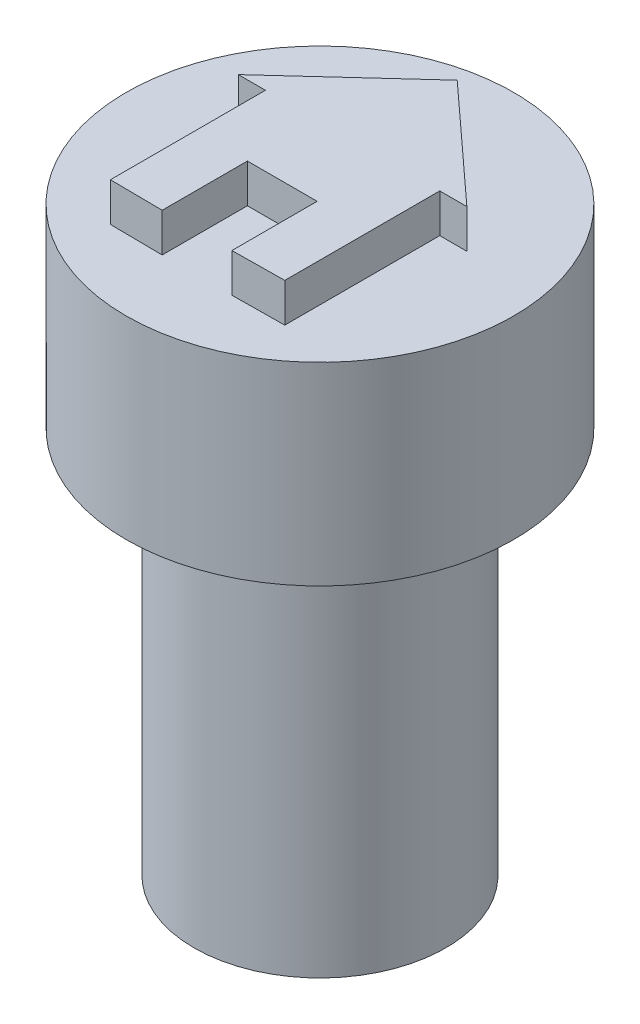
ISO-10303-21;
HEADER;
FILE_DESCRIPTION(('STEP AP214'),'2;1');
FILE_NAME('part.step','',(''),(''),'','','');
FILE_SCHEMA(('AUTOMOTIVE_DESIGN { 1 0 10303 214 1 1 1 1 }'));
ENDSEC;
DATA;
#1=APPLICATION_CONTEXT('core data for automotive mechanical design processes');
#2=APPLICATION_PROTOCOL_DEFINITION('international standard','automotive_design',2000,#1);
#3=PRODUCT_CONTEXT('',#1,'mechanical');
#4=PRODUCT('Part','Part','',(#3));
#5=PRODUCT_RELATED_PRODUCT_CATEGORY('part','',(#4));
#6=PRODUCT_DEFINITION_FORMATION('','',#4);
#7=PRODUCT_DEFINITION_CONTEXT('part definition',#1,'design');
#8=PRODUCT_DEFINITION('design','',#6,#7);
#9=PRODUCT_DEFINITION_SHAPE('','',#8);
#10=(LENGTH_UNIT() NAMED_UNIT(*) SI_UNIT(.MILLI.,.METRE.));
#11=(NAMED_UNIT(*) PLANE_ANGLE_UNIT() SI_UNIT($,.RADIAN.));
#12=(NAMED_UNIT(*) SI_UNIT($,.STERADIAN.) SOLID_ANGLE_UNIT());
#13=UNCERTAINTY_MEASURE_WITH_UNIT(LENGTH_MEASURE(1.E-05),#10,'distance_accuracy_value','');
#14=(GEOMETRIC_REPRESENTATION_CONTEXT(3) GLOBAL_UNCERTAINTY_ASSIGNED_CONTEXT((#13)) GLOBAL_UNIT_ASSIGNED_CONTEXT((#10,
#11,#12)) REPRESENTATION_CONTEXT('',''));
#15=CARTESIAN_POINT('',(0.,0.,0.));
#16=DIRECTION('',(0.,0.,1.));
#17=DIRECTION('',(1.,0.,0.));
#18=AXIS2_PLACEMENT_3D('',#15,#16,#17);
#19=CARTESIAN_POINT('',(0.,10.,0.));
#20=DIRECTION('',(0.,-1.,0.));
#21=DIRECTION('',(0.,0.,-1.));
#22=AXIS2_PLACEMENT_3D('',#19,#20,#21);
#23=CYLINDRICAL_SURFACE('',#22,3.25);
#24=CARTESIAN_POINT('',(0.,10.,0.));
#25=DIRECTION('',(0.,1.,0.));
#26=DIRECTION('',(0.,0.,1.));
#27=AXIS2_PLACEMENT_3D('',#24,#25,#26);
#28=CIRCLE('',#27,3.25);
#29=CARTESIAN_POINT('',(0.,10.,3.25));
#30=VERTEX_POINT('',#29);
#31=EDGE_CURVE('E11',#30,#30,#28,.T.);
#32=ORIENTED_EDGE('',*,*,#31,.F.);
#33=EDGE_LOOP('',(#32));
#34=FACE_BOUND('',#33,.T.);
#35=CARTESIAN_POINT('',(0.,0.,0.));
#36=DIRECTION('',(0.,1.,0.));
#37=DIRECTION('',(0.,0.,1.));
#38=AXIS2_PLACEMENT_3D('',#35,#36,#37);
#39=CIRCLE('',#38,3.25);
#40=CARTESIAN_POINT('',(0.,0.,3.25));
#41=VERTEX_POINT('',#40);
#42=EDGE_CURVE('E48',#41,#41,#39,.T.);
#43=ORIENTED_EDGE('',*,*,#42,.T.);
#44=EDGE_LOOP('',(#43));
#45=FACE_BOUND('',#44,.T.);
#46=ADVANCED_FACE('F45',(#34,#45),#23,.T.);
#47=CARTESIAN_POINT('',(0.,0.,0.));
#48=DIRECTION('',(0.,1.,0.));
#49=DIRECTION('',(0.,0.,1.));
#50=AXIS2_PLACEMENT_3D('',#47,#48,#49);
#51=PLANE('',#50);
#52=CARTESIAN_POINT('',(0.,0.,0.));
#53=DIRECTION('',(0.,-1.,0.));
#54=DIRECTION('',(0.,0.,-1.));
#55=AXIS2_PLACEMENT_3D('',#52,#53,#54);
#56=CIRCLE('',#55,1.75);
#57=CARTESIAN_POINT('',(0.,0.,-1.75));
#58=VERTEX_POINT('',#57);
#59=EDGE_CURVE('E164',#58,#58,#56,.T.);
#60=ORIENTED_EDGE('',*,*,#59,.F.);
#61=EDGE_LOOP('',(#60));
#62=FACE_BOUND('',#61,.T.);
#63=ORIENTED_EDGE('',*,*,#42,.F.);
#64=EDGE_LOOP('',(#63));
#65=FACE_BOUND('',#64,.T.);
#66=ADVANCED_FACE('F176',(#62,#65),#51,.F.);
#67=CARTESIAN_POINT('',(0.,2.5,0.));
#68=DIRECTION('',(0.,-1.,0.));
#69=DIRECTION('',(0.,0.,-1.));
#70=AXIS2_PLACEMENT_3D('',#67,#68,#69);
#71=CYLINDRICAL_SURFACE('',#70,1.75);
#72=CARTESIAN_POINT('',(0.,2.5,0.));
#73=DIRECTION('',(0.,-1.,0.));
#74=DIRECTION('',(0.,0.,-1.));
#75=AXIS2_PLACEMENT_3D('',#72,#73,#74);
#76=CIRCLE('',#75,1.75);
#77=CARTESIAN_POINT('',(0.,2.5,-1.75));
#78=VERTEX_POINT('',#77);
#79=EDGE_CURVE('E166',#78,#78,#76,.T.);
#80=ORIENTED_EDGE('',*,*,#79,.F.);
#81=EDGE_LOOP('',(#80));
#82=FACE_BOUND('',#81,.T.);
#83=ORIENTED_EDGE('',*,*,#59,.T.);
#84=EDGE_LOOP('',(#83));
#85=FACE_BOUND('',#84,.T.);
#86=ADVANCED_FACE('F174',(#82,#85),#71,.F.);
#87=CARTESIAN_POINT('',(0.,2.5,0.));
#88=DIRECTION('',(0.,-1.,0.));
#89=DIRECTION('',(0.,0.,-1.));
#90=AXIS2_PLACEMENT_3D('',#87,#88,#89);
#91=PLANE('',#90);
#92=ORIENTED_EDGE('',*,*,#79,.T.);
#93=EDGE_LOOP('',(#92));
#94=FACE_BOUND('',#93,.T.);
#95=ADVANCED_FACE('F198',(#94),#91,.T.);
#96=CARTESIAN_POINT('',(0.,15.,0.));
#97=DIRECTION('',(0.,-1.,0.));
#98=DIRECTION('',(0.,0.,-1.));
#99=AXIS2_PLACEMENT_3D('',#96,#97,#98);
#100=CYLINDRICAL_SURFACE('',#99,5.);
#101=CARTESIAN_POINT('',(0.,15.,0.));
#102=DIRECTION('',(0.,1.,0.));
#103=DIRECTION('',(0.,0.,1.));
#104=AXIS2_PLACEMENT_3D('',#101,#102,#103);
#105=CIRCLE('',#104,5.);
#106=CARTESIAN_POINT('',(0.,15.,5.));
#107=VERTEX_POINT('',#106);
#108=EDGE_CURVE('E156',#107,#107,#105,.T.);
#109=ORIENTED_EDGE('',*,*,#108,.F.);
#110=EDGE_LOOP('',(#109));
#111=FACE_BOUND('',#110,.T.);
#112=CARTESIAN_POINT('',(0.,10.,0.));
#113=DIRECTION('',(0.,1.,0.));
#114=DIRECTION('',(0.,0.,1.));
#115=AXIS2_PLACEMENT_3D('',#112,#113,#114);
#116=CIRCLE('',#115,5.);
#117=CARTESIAN_POINT('',(0.,10.,5.));
#118=VERTEX_POINT('',#117);
#119=EDGE_CURVE('E151',#118,#118,#116,.T.);
#120=ORIENTED_EDGE('',*,*,#119,.T.);
#121=EDGE_LOOP('',(#120));
#122=FACE_BOUND('',#121,.T.);
#123=ADVANCED_FACE('F196',(#111,#122),#100,.T.);
#124=CARTESIAN_POINT('',(0.,15.,0.));
#125=DIRECTION('',(0.,1.,0.));
#126=DIRECTION('',(0.,0.,1.));
#127=AXIS2_PLACEMENT_3D('',#124,#125,#126);
#128=PLANE('',#127);
#129=DIRECTION('',(-0.737672912354375,0.,-0.675158258765021));
#130=VECTOR('',#129,1.);
#131=CARTESIAN_POINT('',(2.95,15.,-0.842487973796764));
#132=LINE('',#131,#130);
#133=CARTESIAN_POINT('',(2.95,15.,-0.842487973796764));
#134=VERTEX_POINT('',#133);
#135=CARTESIAN_POINT('',(0.,15.,-3.54248797379676));
#136=VERTEX_POINT('',#135);
#137=EDGE_CURVE('E60',#134,#136,#132,.T.);
#138=ORIENTED_EDGE('',*,*,#137,.F.);
#139=DIRECTION('',(1.,0.,0.));
#140=VECTOR('',#139,1.);
#141=CARTESIAN_POINT('',(2.25,15.,-0.842487973796764));
#142=LINE('',#141,#140);
#143=CARTESIAN_POINT('',(2.25,15.,-0.842487973796764));
#144=VERTEX_POINT('',#143);
#145=EDGE_CURVE('E64',#144,#134,#142,.T.);
#146=ORIENTED_EDGE('',*,*,#145,.F.);
#147=DIRECTION('',(0.,0.,-1.));
#148=VECTOR('',#147,1.);
#149=CARTESIAN_POINT('',(2.25,15.,3.15751202620324));
#150=LINE('',#149,#148);
#151=CARTESIAN_POINT('',(2.25,15.,3.15751202620324));
#152=VERTEX_POINT('',#151);
#153=EDGE_CURVE('E361',#152,#144,#150,.T.);
#154=ORIENTED_EDGE('',*,*,#153,.F.);
#155=DIRECTION('',(0.99993946534493,0.,-0.0110029834906805));
#156=VECTOR('',#155,1.);
#157=CARTESIAN_POINT('',(0.9,15.,3.17236695315353));
#158=LINE('',#157,#156);
#159=CARTESIAN_POINT('',(0.9,15.,3.17236695315353));
#160=VERTEX_POINT('',#159);
#161=EDGE_CURVE('E430',#160,#152,#158,.T.);
#162=ORIENTED_EDGE('',*,*,#161,.F.);
#163=DIRECTION('',(0.,0.,1.));
#164=VECTOR('',#163,1.);
#165=CARTESIAN_POINT('',(0.9,15.,0.972366953153534));
#166=LINE('',#165,#164);
#167=CARTESIAN_POINT('',(0.9,15.,0.972366953153534));
#168=VERTEX_POINT('',#167);
#169=EDGE_CURVE('E426',#168,#160,#166,.T.);
#170=ORIENTED_EDGE('',*,*,#169,.F.);
#171=DIRECTION('',(1.,0.,0.));
#172=VECTOR('',#171,1.);
#173=CARTESIAN_POINT('',(-0.9,15.,0.972366953153534));
#174=LINE('',#173,#172);
#175=CARTESIAN_POINT('',(-0.9,15.,0.972366953153534));
#176=VERTEX_POINT('',#175);
#177=EDGE_CURVE('E422',#176,#168,#174,.T.);
#178=ORIENTED_EDGE('',*,*,#177,.F.);
#179=DIRECTION('',(0.,0.,-1.));
#180=VECTOR('',#179,1.);
#181=CARTESIAN_POINT('',(-0.9,15.,3.17236695315353));
#182=LINE('',#181,#180);
#183=CARTESIAN_POINT('',(-0.9,15.,3.17236695315353));
#184=VERTEX_POINT('',#183);
#185=EDGE_CURVE('E418',#184,#176,#182,.T.);
#186=ORIENTED_EDGE('',*,*,#185,.F.);
#187=DIRECTION('',(0.99993946534493,0.,0.0110029834906805));
#188=VECTOR('',#187,1.);
#189=CARTESIAN_POINT('',(-2.25,15.,3.15751202620324));
#190=LINE('',#189,#188);
#191=CARTESIAN_POINT('',(-2.25,15.,3.15751202620324));
#192=VERTEX_POINT('',#191);
#193=EDGE_CURVE('E410',#192,#184,#190,.T.);
#194=ORIENTED_EDGE('',*,*,#193,.F.);
#195=DIRECTION('',(0.,0.,1.));
#196=VECTOR('',#195,1.);
#197=CARTESIAN_POINT('',(-2.25,15.,-0.842487973796764));
#198=LINE('',#197,#196);
#199=CARTESIAN_POINT('',(-2.25,15.,-0.842487973796764));
#200=VERTEX_POINT('',#199);
#201=EDGE_CURVE('E401',#200,#192,#198,.T.);
#202=ORIENTED_EDGE('',*,*,#201,.F.);
#203=DIRECTION('',(1.,0.,0.));
#204=VECTOR('',#203,1.);
#205=CARTESIAN_POINT('',(-2.95,15.,-0.842487973796764));
#206=LINE('',#205,#204);
#207=CARTESIAN_POINT('',(-2.95,15.,-0.842487973796764));
#208=VERTEX_POINT('',#207);
#209=EDGE_CURVE('E404',#208,#200,#206,.T.);
#210=ORIENTED_EDGE('',*,*,#209,.F.);
#211=DIRECTION('',(-0.737672912354375,0.,0.675158258765021));
#212=VECTOR('',#211,1.);
#213=CARTESIAN_POINT('',(0.,15.,-3.54248797379676));
#214=LINE('',#213,#212);
#215=EDGE_CURVE('E406',#136,#208,#214,.T.);
#216=ORIENTED_EDGE('',*,*,#215,.F.);
#217=EDGE_LOOP('',(#138,#146,#154,#162,#170,#178,#186,#194,#202,#210,#216));
#218=FACE_BOUND('',#217,.T.);
#219=ORIENTED_EDGE('',*,*,#108,.T.);
#220=EDGE_LOOP('',(#219));
#221=FACE_BOUND('',#220,.T.);
#222=ADVANCED_FACE('F192',(#218,#221),#128,.T.);
#223=CARTESIAN_POINT('',(0.,10.,0.));
#224=DIRECTION('',(0.,1.,0.));
#225=DIRECTION('',(0.,0.,1.));
#226=AXIS2_PLACEMENT_3D('',#223,#224,#225);
#227=PLANE('',#226);
#228=ORIENTED_EDGE('',*,*,#31,.T.);
#229=EDGE_LOOP('',(#228));
#230=FACE_BOUND('',#229,.T.);
#231=ORIENTED_EDGE('',*,*,#119,.F.);
#232=EDGE_LOOP('',(#231));
#233=FACE_BOUND('',#232,.T.);
#234=ADVANCED_FACE('F189',(#230,#233),#227,.F.);
#235=CARTESIAN_POINT('',(2.95,16.,-0.842487973796764));
#236=DIRECTION('',(-0.675158258765021,0.,0.737672912354375));
#237=DIRECTION('',(0.737672912354375,0.,0.675158258765021));
#238=AXIS2_PLACEMENT_3D('',#235,#236,#237);
#239=PLANE('',#238);
#240=ORIENTED_EDGE('',*,*,#137,.T.);
#241=DIRECTION('',(0.,-1.,0.));
#242=VECTOR('',#241,1.);
#243=CARTESIAN_POINT('',(0.,16.,-3.54248797379676));
#244=LINE('',#243,#242);
#245=CARTESIAN_POINT('',(0.,16.,-3.54248797379676));
#246=VERTEX_POINT('',#245);
#247=EDGE_CURVE('E131',#246,#136,#244,.T.);
#248=ORIENTED_EDGE('',*,*,#247,.F.);
#249=DIRECTION('',(-0.737672912354375,0.,-0.675158258765021));
#250=VECTOR('',#249,1.);
#251=CARTESIAN_POINT('',(2.95,16.,-0.842487973796764));
#252=LINE('',#251,#250);
#253=CARTESIAN_POINT('',(2.95,16.,-0.842487973796764));
#254=VERTEX_POINT('',#253);
#255=EDGE_CURVE('E138',#254,#246,#252,.T.);
#256=ORIENTED_EDGE('',*,*,#255,.F.);
#257=DIRECTION('',(0.,-1.,0.));
#258=VECTOR('',#257,1.);
#259=CARTESIAN_POINT('',(2.95,16.,-0.842487973796764));
#260=LINE('',#259,#258);
#261=EDGE_CURVE('E357',#254,#134,#260,.T.);
#262=ORIENTED_EDGE('',*,*,#261,.T.);
#263=EDGE_LOOP('',(#240,#248,#256,#262));
#264=FACE_BOUND('',#263,.T.);
#265=ADVANCED_FACE('F149',(#264),#239,.F.);
#266=CARTESIAN_POINT('',(0.,16.,-3.54248797379676));
#267=DIRECTION('',(0.675158258765021,0.,0.737672912354375));
#268=DIRECTION('',(0.737672912354375,0.,-0.675158258765021));
#269=AXIS2_PLACEMENT_3D('',#266,#267,#268);
#270=PLANE('',#269);
#271=ORIENTED_EDGE('',*,*,#215,.T.);
#272=DIRECTION('',(0.,-1.,0.));
#273=VECTOR('',#272,1.);
#274=CARTESIAN_POINT('',(-2.95,16.,-0.842487973796764));
#275=LINE('',#274,#273);
#276=CARTESIAN_POINT('',(-2.95,16.,-0.842487973796764));
#277=VERTEX_POINT('',#276);
#278=EDGE_CURVE('E133',#277,#208,#275,.T.);
#279=ORIENTED_EDGE('',*,*,#278,.F.);
#280=DIRECTION('',(-0.737672912354375,0.,0.675158258765021));
#281=VECTOR('',#280,1.);
#282=CARTESIAN_POINT('',(0.,16.,-3.54248797379676));
#283=LINE('',#282,#281);
#284=EDGE_CURVE('E126',#246,#277,#283,.T.);
#285=ORIENTED_EDGE('',*,*,#284,.F.);
#286=ORIENTED_EDGE('',*,*,#247,.T.);
#287=EDGE_LOOP('',(#271,#279,#285,#286));
#288=FACE_BOUND('',#287,.T.);
#289=ADVANCED_FACE('F129',(#288),#270,.F.);
#290=CARTESIAN_POINT('',(-2.95,16.,-0.842487973796764));
#291=DIRECTION('',(0.,0.,-1.));
#292=DIRECTION('',(-1.,0.,0.));
#293=AXIS2_PLACEMENT_3D('',#290,#291,#292);
#294=PLANE('',#293);
#295=ORIENTED_EDGE('',*,*,#209,.T.);
#296=DIRECTION('',(0.,-1.,0.));
#297=VECTOR('',#296,1.);
#298=CARTESIAN_POINT('',(-2.25,16.,-0.842487973796764));
#299=LINE('',#298,#297);
#300=CARTESIAN_POINT('',(-2.25,16.,-0.842487973796764));
#301=VERTEX_POINT('',#300);
#302=EDGE_CURVE('E158',#301,#200,#299,.T.);
#303=ORIENTED_EDGE('',*,*,#302,.F.);
#304=DIRECTION('',(1.,0.,0.));
#305=VECTOR('',#304,1.);
#306=CARTESIAN_POINT('',(-2.95,16.,-0.842487973796764));
#307=LINE('',#306,#305);
#308=EDGE_CURVE('E137',#277,#301,#307,.T.);
#309=ORIENTED_EDGE('',*,*,#308,.F.);
#310=ORIENTED_EDGE('',*,*,#278,.T.);
#311=EDGE_LOOP('',(#295,#303,#309,#310));
#312=FACE_BOUND('',#311,.T.);
#313=ADVANCED_FACE('F256',(#312),#294,.F.);
#314=CARTESIAN_POINT('',(-2.25,16.,-0.842487973796764));
#315=DIRECTION('',(1.,0.,0.));
#316=DIRECTION('',(0.,0.,-1.));
#317=AXIS2_PLACEMENT_3D('',#314,#315,#316);
#318=PLANE('',#317);
#319=ORIENTED_EDGE('',*,*,#201,.T.);
#320=DIRECTION('',(0.,-1.,0.));
#321=VECTOR('',#320,1.);
#322=CARTESIAN_POINT('',(-2.25,16.,3.15751202620324));
#323=LINE('',#322,#321);
#324=CARTESIAN_POINT('',(-2.25,16.,3.15751202620324));
#325=VERTEX_POINT('',#324);
#326=EDGE_CURVE('E392',#325,#192,#323,.T.);
#327=ORIENTED_EDGE('',*,*,#326,.F.);
#328=DIRECTION('',(0.,0.,1.));
#329=VECTOR('',#328,1.);
#330=CARTESIAN_POINT('',(-2.25,16.,-0.842487973796764));
#331=LINE('',#330,#329);
#332=EDGE_CURVE('E402',#301,#325,#331,.T.);
#333=ORIENTED_EDGE('',*,*,#332,.F.);
#334=ORIENTED_EDGE('',*,*,#302,.T.);
#335=EDGE_LOOP('',(#319,#327,#333,#334));
#336=FACE_BOUND('',#335,.T.);
#337=ADVANCED_FACE('F265',(#336),#318,.F.);
#338=CARTESIAN_POINT('',(-2.25,16.,3.15751202620324));
#339=DIRECTION('',(0.0110029834906805,0.,-0.99993946534493));
#340=DIRECTION('',(-0.99993946534493,0.,-0.0110029834906805));
#341=AXIS2_PLACEMENT_3D('',#338,#339,#340);
#342=PLANE('',#341);
#343=ORIENTED_EDGE('',*,*,#193,.T.);
#344=DIRECTION('',(0.,-1.,0.));
#345=VECTOR('',#344,1.);
#346=CARTESIAN_POINT('',(-0.9,16.,3.17236695315353));
#347=LINE('',#346,#345);
#348=CARTESIAN_POINT('',(-0.9,16.,3.17236695315353));
#349=VERTEX_POINT('',#348);
#350=EDGE_CURVE('E388',#349,#184,#347,.T.);
#351=ORIENTED_EDGE('',*,*,#350,.F.);
#352=DIRECTION('',(0.99993946534493,0.,0.0110029834906805));
#353=VECTOR('',#352,1.);
#354=CARTESIAN_POINT('',(-2.25,16.,3.15751202620324));
#355=LINE('',#354,#353);
#356=EDGE_CURVE('E450',#325,#349,#355,.T.);
#357=ORIENTED_EDGE('',*,*,#356,.F.);
#358=ORIENTED_EDGE('',*,*,#326,.T.);
#359=EDGE_LOOP('',(#343,#351,#357,#358));
#360=FACE_BOUND('',#359,.T.);
#361=ADVANCED_FACE('F275',(#360),#342,.F.);
#362=CARTESIAN_POINT('',(-0.9,16.,3.17236695315353));
#363=DIRECTION('',(-1.,0.,0.));
#364=DIRECTION('',(0.,0.,1.));
#365=AXIS2_PLACEMENT_3D('',#362,#363,#364);
#366=PLANE('',#365);
#367=ORIENTED_EDGE('',*,*,#185,.T.);
#368=DIRECTION('',(0.,-1.,0.));
#369=VECTOR('',#368,1.);
#370=CARTESIAN_POINT('',(-0.9,16.,0.972366953153534));
#371=LINE('',#370,#369);
#372=CARTESIAN_POINT('',(-0.9,16.,0.972366953153534));
#373=VERTEX_POINT('',#372);
#374=EDGE_CURVE('E384',#373,#176,#371,.T.);
#375=ORIENTED_EDGE('',*,*,#374,.F.);
#376=DIRECTION('',(0.,0.,-1.));
#377=VECTOR('',#376,1.);
#378=CARTESIAN_POINT('',(-0.9,16.,3.17236695315353));
#379=LINE('',#378,#377);
#380=EDGE_CURVE('E447',#349,#373,#379,.T.);
#381=ORIENTED_EDGE('',*,*,#380,.F.);
#382=ORIENTED_EDGE('',*,*,#350,.T.);
#383=EDGE_LOOP('',(#367,#375,#381,#382));
#384=FACE_BOUND('',#383,.T.);
#385=ADVANCED_FACE('F285',(#384),#366,.F.);
#386=CARTESIAN_POINT('',(-0.9,16.,0.972366953153534));
#387=DIRECTION('',(0.,0.,-1.));
#388=DIRECTION('',(-1.,0.,0.));
#389=AXIS2_PLACEMENT_3D('',#386,#387,#388);
#390=PLANE('',#389);
#391=ORIENTED_EDGE('',*,*,#177,.T.);
#392=DIRECTION('',(0.,-1.,0.));
#393=VECTOR('',#392,1.);
#394=CARTESIAN_POINT('',(0.9,16.,0.972366953153534));
#395=LINE('',#394,#393);
#396=CARTESIAN_POINT('',(0.9,16.,0.972366953153534));
#397=VERTEX_POINT('',#396);
#398=EDGE_CURVE('E380',#397,#168,#395,.T.);
#399=ORIENTED_EDGE('',*,*,#398,.F.);
#400=DIRECTION('',(1.,0.,0.));
#401=VECTOR('',#400,1.);
#402=CARTESIAN_POINT('',(-0.9,16.,0.972366953153534));
#403=LINE('',#402,#401);
#404=EDGE_CURVE('E445',#373,#397,#403,.T.);
#405=ORIENTED_EDGE('',*,*,#404,.F.);
#406=ORIENTED_EDGE('',*,*,#374,.T.);
#407=EDGE_LOOP('',(#391,#399,#405,#406));
#408=FACE_BOUND('',#407,.T.);
#409=ADVANCED_FACE('F295',(#408),#390,.F.);
#410=CARTESIAN_POINT('',(0.9,16.,0.972366953153534));
#411=DIRECTION('',(1.,0.,0.));
#412=DIRECTION('',(0.,0.,-1.));
#413=AXIS2_PLACEMENT_3D('',#410,#411,#412);
#414=PLANE('',#413);
#415=ORIENTED_EDGE('',*,*,#169,.T.);
#416=DIRECTION('',(0.,-1.,0.));
#417=VECTOR('',#416,1.);
#418=CARTESIAN_POINT('',(0.9,16.,3.17236695315353));
#419=LINE('',#418,#417);
#420=CARTESIAN_POINT('',(0.9,16.,3.17236695315353));
#421=VERTEX_POINT('',#420);
#422=EDGE_CURVE('E376',#421,#160,#419,.T.);
#423=ORIENTED_EDGE('',*,*,#422,.F.);
#424=DIRECTION('',(0.,0.,1.));
#425=VECTOR('',#424,1.);
#426=CARTESIAN_POINT('',(0.9,16.,0.972366953153534));
#427=LINE('',#426,#425);
#428=EDGE_CURVE('E441',#397,#421,#427,.T.);
#429=ORIENTED_EDGE('',*,*,#428,.F.);
#430=ORIENTED_EDGE('',*,*,#398,.T.);
#431=EDGE_LOOP('',(#415,#423,#429,#430));
#432=FACE_BOUND('',#431,.T.);
#433=ADVANCED_FACE('F305',(#432),#414,.F.);
#434=CARTESIAN_POINT('',(0.9,16.,3.17236695315353));
#435=DIRECTION('',(-0.0110029834906805,0.,-0.99993946534493));
#436=DIRECTION('',(-0.99993946534493,0.,0.0110029834906805));
#437=AXIS2_PLACEMENT_3D('',#434,#435,#436);
#438=PLANE('',#437);
#439=ORIENTED_EDGE('',*,*,#161,.T.);
#440=DIRECTION('',(0.,-1.,0.));
#441=VECTOR('',#440,1.);
#442=CARTESIAN_POINT('',(2.25,16.,3.15751202620324));
#443=LINE('',#442,#441);
#444=CARTESIAN_POINT('',(2.25,16.,3.15751202620324));
#445=VERTEX_POINT('',#444);
#446=EDGE_CURVE('E367',#445,#152,#443,.T.);
#447=ORIENTED_EDGE('',*,*,#446,.F.);
#448=DIRECTION('',(0.99993946534493,0.,-0.0110029834906805));
#449=VECTOR('',#448,1.);
#450=CARTESIAN_POINT('',(0.9,16.,3.17236695315353));
#451=LINE('',#450,#449);
#452=EDGE_CURVE('E439',#421,#445,#451,.T.);
#453=ORIENTED_EDGE('',*,*,#452,.F.);
#454=ORIENTED_EDGE('',*,*,#422,.T.);
#455=EDGE_LOOP('',(#439,#447,#453,#454));
#456=FACE_BOUND('',#455,.T.);
#457=ADVANCED_FACE('F315',(#456),#438,.F.);
#458=CARTESIAN_POINT('',(2.25,16.,3.15751202620324));
#459=DIRECTION('',(-1.,0.,0.));
#460=DIRECTION('',(0.,0.,1.));
#461=AXIS2_PLACEMENT_3D('',#458,#459,#460);
#462=PLANE('',#461);
#463=ORIENTED_EDGE('',*,*,#153,.T.);
#464=DIRECTION('',(0.,-1.,0.));
#465=VECTOR('',#464,1.);
#466=CARTESIAN_POINT('',(2.25,16.,-0.842487973796764));
#467=LINE('',#466,#465);
#468=CARTESIAN_POINT('',(2.25,16.,-0.842487973796764));
#469=VERTEX_POINT('',#468);
#470=EDGE_CURVE('E359',#469,#144,#467,.T.);
#471=ORIENTED_EDGE('',*,*,#470,.F.);
#472=DIRECTION('',(0.,0.,-1.));
#473=VECTOR('',#472,1.);
#474=CARTESIAN_POINT('',(2.25,16.,3.15751202620324));
#475=LINE('',#474,#473);
#476=EDGE_CURVE('E369',#445,#469,#475,.T.);
#477=ORIENTED_EDGE('',*,*,#476,.F.);
#478=ORIENTED_EDGE('',*,*,#446,.T.);
#479=EDGE_LOOP('',(#463,#471,#477,#478));
#480=FACE_BOUND('',#479,.T.);
#481=ADVANCED_FACE('F325',(#480),#462,.F.);
#482=CARTESIAN_POINT('',(2.25,16.,-0.842487973796764));
#483=DIRECTION('',(0.,0.,-1.));
#484=DIRECTION('',(-1.,0.,0.));
#485=AXIS2_PLACEMENT_3D('',#482,#483,#484);
#486=PLANE('',#485);
#487=ORIENTED_EDGE('',*,*,#145,.T.);
#488=ORIENTED_EDGE('',*,*,#261,.F.);
#489=DIRECTION('',(1.,0.,0.));
#490=VECTOR('',#489,1.);
#491=CARTESIAN_POINT('',(2.25,16.,-0.842487973796764));
#492=LINE('',#491,#490);
#493=EDGE_CURVE('E143',#469,#254,#492,.T.);
#494=ORIENTED_EDGE('',*,*,#493,.F.);
#495=ORIENTED_EDGE('',*,*,#470,.T.);
#496=EDGE_LOOP('',(#487,#488,#494,#495));
#497=FACE_BOUND('',#496,.T.);
#498=ADVANCED_FACE('F335',(#497),#486,.F.);
#499=CARTESIAN_POINT('',(0.,16.,0.));
#500=DIRECTION('',(0.,1.,0.));
#501=DIRECTION('',(0.,0.,1.));
#502=AXIS2_PLACEMENT_3D('',#499,#500,#501);
#503=PLANE('',#502);
#504=ORIENTED_EDGE('',*,*,#255,.T.);
#505=ORIENTED_EDGE('',*,*,#284,.T.);
#506=ORIENTED_EDGE('',*,*,#308,.T.);
#507=ORIENTED_EDGE('',*,*,#332,.T.);
#508=ORIENTED_EDGE('',*,*,#356,.T.);
#509=ORIENTED_EDGE('',*,*,#380,.T.);
#510=ORIENTED_EDGE('',*,*,#404,.T.);
#511=ORIENTED_EDGE('',*,*,#428,.T.);
#512=ORIENTED_EDGE('',*,*,#452,.T.);
#513=ORIENTED_EDGE('',*,*,#476,.T.);
#514=ORIENTED_EDGE('',*,*,#493,.T.);
#515=EDGE_LOOP('',(#504,#505,#506,#507,#508,#509,#510,#511,#512,#513,#514));
#516=FACE_BOUND('',#515,.T.);
#517=ADVANCED_FACE('F141',(#516),#503,.T.);
#518=CLOSED_SHELL('',(#46,#66,#86,#95,#123,#222,#234,#265,#289,#313,#337,#361,#385,#409,#433,
#457,#481,#498,#517));
#519=MANIFOLD_SOLID_BREP('B2',#518);
#520=ADVANCED_BREP_SHAPE_REPRESENTATION('',(#18,#519),#14);
#521=SHAPE_DEFINITION_REPRESENTATION(#9,#520);
ENDSEC;
END-ISO-10303-21;
